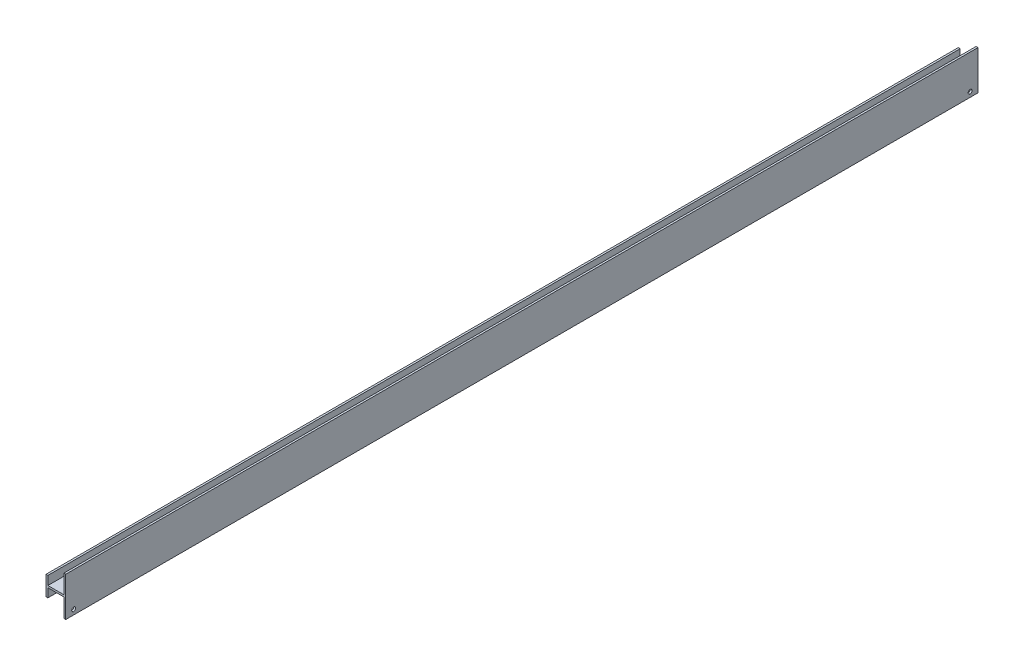
ISO-10303-21;
HEADER;
FILE_DESCRIPTION(('STEP AP214'),'2;1');
FILE_NAME('part.step','',(''),(''),'','','');
FILE_SCHEMA(('AUTOMOTIVE_DESIGN { 1 0 10303 214 1 1 1 1 }'));
ENDSEC;
DATA;
#1=APPLICATION_CONTEXT('core data for automotive mechanical design processes');
#2=APPLICATION_PROTOCOL_DEFINITION('international standard','automotive_design',2000,#1);
#3=PRODUCT_CONTEXT('',#1,'mechanical');
#4=PRODUCT('Part','Part','',(#3));
#5=PRODUCT_RELATED_PRODUCT_CATEGORY('part','',(#4));
#6=PRODUCT_DEFINITION_FORMATION('','',#4);
#7=PRODUCT_DEFINITION_CONTEXT('part definition',#1,'design');
#8=PRODUCT_DEFINITION('design','',#6,#7);
#9=PRODUCT_DEFINITION_SHAPE('','',#8);
#10=(LENGTH_UNIT() NAMED_UNIT(*) SI_UNIT(.MILLI.,.METRE.));
#11=(NAMED_UNIT(*) PLANE_ANGLE_UNIT() SI_UNIT($,.RADIAN.));
#12=(NAMED_UNIT(*) SI_UNIT($,.STERADIAN.) SOLID_ANGLE_UNIT());
#13=UNCERTAINTY_MEASURE_WITH_UNIT(LENGTH_MEASURE(1.E-05),#10,'distance_accuracy_value','');
#14=(GEOMETRIC_REPRESENTATION_CONTEXT(3) GLOBAL_UNCERTAINTY_ASSIGNED_CONTEXT((#13)) GLOBAL_UNIT_ASSIGNED_CONTEXT((#10,
#11,#12)) REPRESENTATION_CONTEXT('',''));
#15=CARTESIAN_POINT('',(0.,0.,0.));
#16=DIRECTION('',(0.,0.,1.));
#17=DIRECTION('',(1.,0.,0.));
#18=AXIS2_PLACEMENT_3D('',#15,#16,#17);
#19=CARTESIAN_POINT('',(58.674,15.6718,364.33125));
#20=DIRECTION('',(0.,-1.,0.));
#21=DIRECTION('',(0.,0.,-1.));
#22=AXIS2_PLACEMENT_3D('',#19,#20,#21);
#23=PLANE('',#22);
#24=DIRECTION('',(-1.,0.,0.));
#25=VECTOR('',#24,1.);
#26=CARTESIAN_POINT('',(58.674,15.6718,-364.33125));
#27=LINE('',#26,#25);
#28=CARTESIAN_POINT('',(58.674,15.6718,-364.33125));
#29=VERTEX_POINT('',#28);
#30=CARTESIAN_POINT('',(57.15,15.6718,-364.33125));
#31=VERTEX_POINT('',#30);
#32=EDGE_CURVE('E151',#29,#31,#27,.T.);
#33=ORIENTED_EDGE('',*,*,#32,.T.);
#34=DIRECTION('',(0.,0.,-1.));
#35=VECTOR('',#34,1.);
#36=CARTESIAN_POINT('',(57.15,15.6718,364.33125));
#37=LINE('',#36,#35);
#38=CARTESIAN_POINT('',(57.15,15.6718,364.33125));
#39=VERTEX_POINT('',#38);
#40=EDGE_CURVE('E11',#39,#31,#37,.T.);
#41=ORIENTED_EDGE('',*,*,#40,.F.);
#42=DIRECTION('',(-1.,0.,0.));
#43=VECTOR('',#42,1.);
#44=CARTESIAN_POINT('',(58.674,15.6718,364.33125));
#45=LINE('',#44,#43);
#46=CARTESIAN_POINT('',(58.674,15.6718,364.33125));
#47=VERTEX_POINT('',#46);
#48=EDGE_CURVE('E174',#47,#39,#45,.T.);
#49=ORIENTED_EDGE('',*,*,#48,.F.);
#50=DIRECTION('',(0.,0.,-1.));
#51=VECTOR('',#50,1.);
#52=CARTESIAN_POINT('',(58.674,15.6718,364.33125));
#53=LINE('',#52,#51);
#54=EDGE_CURVE('E147',#47,#29,#53,.T.);
#55=ORIENTED_EDGE('',*,*,#54,.T.);
#56=EDGE_LOOP('',(#33,#41,#49,#55));
#57=FACE_BOUND('',#56,.T.);
#58=ADVANCED_FACE('F31',(#57),#23,.F.);
#59=CARTESIAN_POINT('',(57.15,15.6718,364.33125));
#60=DIRECTION('',(1.,0.,0.));
#61=DIRECTION('',(0.,0.,-1.));
#62=AXIS2_PLACEMENT_3D('',#59,#60,#61);
#63=PLANE('',#62);
#64=DIRECTION('',(0.,-1.,0.));
#65=VECTOR('',#64,1.);
#66=CARTESIAN_POINT('',(57.15,15.6718,-364.33125));
#67=LINE('',#66,#65);
#68=CARTESIAN_POINT('',(57.15,0.762,-364.33125));
#69=VERTEX_POINT('',#68);
#70=EDGE_CURVE('E154',#31,#69,#67,.T.);
#71=ORIENTED_EDGE('',*,*,#70,.T.);
#72=DIRECTION('',(0.,0.,-1.));
#73=VECTOR('',#72,1.);
#74=CARTESIAN_POINT('',(57.15,0.762,364.33125));
#75=LINE('',#74,#73);
#76=CARTESIAN_POINT('',(57.15,0.762,364.33125));
#77=VERTEX_POINT('',#76);
#78=EDGE_CURVE('E39',#77,#69,#75,.T.);
#79=ORIENTED_EDGE('',*,*,#78,.F.);
#80=DIRECTION('',(0.,-1.,0.));
#81=VECTOR('',#80,1.);
#82=CARTESIAN_POINT('',(57.15,15.6718,364.33125));
#83=LINE('',#82,#81);
#84=EDGE_CURVE('E102',#39,#77,#83,.T.);
#85=ORIENTED_EDGE('',*,*,#84,.F.);
#86=ORIENTED_EDGE('',*,*,#40,.T.);
#87=EDGE_LOOP('',(#71,#79,#85,#86));
#88=FACE_BOUND('',#87,.T.);
#89=ADVANCED_FACE('F255',(#88),#63,.F.);
#90=CARTESIAN_POINT('',(44.45,0.762,364.33125));
#91=DIRECTION('',(0.,-1.,0.));
#92=DIRECTION('',(0.,0.,-1.));
#93=AXIS2_PLACEMENT_3D('',#90,#91,#92);
#94=PLANE('',#93);
#95=DIRECTION('',(-1.,0.,0.));
#96=VECTOR('',#95,1.);
#97=CARTESIAN_POINT('',(44.45,0.762,-364.33125));
#98=LINE('',#97,#96);
#99=CARTESIAN_POINT('',(44.45,0.762,-364.33125));
#100=VERTEX_POINT('',#99);
#101=EDGE_CURVE('E157',#69,#100,#98,.T.);
#102=ORIENTED_EDGE('',*,*,#101,.T.);
#103=DIRECTION('',(0.,0.,-1.));
#104=VECTOR('',#103,1.);
#105=CARTESIAN_POINT('',(44.45,0.762,364.33125));
#106=LINE('',#105,#104);
#107=CARTESIAN_POINT('',(44.45,0.762,364.33125));
#108=VERTEX_POINT('',#107);
#109=EDGE_CURVE('E193',#108,#100,#106,.T.);
#110=ORIENTED_EDGE('',*,*,#109,.F.);
#111=DIRECTION('',(-1.,0.,0.));
#112=VECTOR('',#111,1.);
#113=CARTESIAN_POINT('',(44.45,0.762,364.33125));
#114=LINE('',#113,#112);
#115=EDGE_CURVE('E201',#77,#108,#114,.T.);
#116=ORIENTED_EDGE('',*,*,#115,.F.);
#117=ORIENTED_EDGE('',*,*,#78,.T.);
#118=EDGE_LOOP('',(#102,#110,#116,#117));
#119=FACE_BOUND('',#118,.T.);
#120=ADVANCED_FACE('F199',(#119),#94,.F.);
#121=CARTESIAN_POINT('',(44.45,7.7851,364.33125));
#122=DIRECTION('',(-1.,0.,0.));
#123=DIRECTION('',(0.,0.,1.));
#124=AXIS2_PLACEMENT_3D('',#121,#122,#123);
#125=PLANE('',#124);
#126=DIRECTION('',(0.,1.,0.));
#127=VECTOR('',#126,1.);
#128=CARTESIAN_POINT('',(44.45,7.7851,-364.33125));
#129=LINE('',#128,#127);
#130=CARTESIAN_POINT('',(44.45,7.7851,-364.33125));
#131=VERTEX_POINT('',#130);
#132=EDGE_CURVE('E159',#100,#131,#129,.T.);
#133=ORIENTED_EDGE('',*,*,#132,.T.);
#134=DIRECTION('',(0.,0.,-1.));
#135=VECTOR('',#134,1.);
#136=CARTESIAN_POINT('',(44.45,7.7851,364.33125));
#137=LINE('',#136,#135);
#138=CARTESIAN_POINT('',(44.45,7.7851,364.33125));
#139=VERTEX_POINT('',#138);
#140=EDGE_CURVE('E190',#139,#131,#137,.T.);
#141=ORIENTED_EDGE('',*,*,#140,.F.);
#142=DIRECTION('',(0.,1.,0.));
#143=VECTOR('',#142,1.);
#144=CARTESIAN_POINT('',(44.45,7.7851,364.33125));
#145=LINE('',#144,#143);
#146=EDGE_CURVE('E219',#108,#139,#145,.T.);
#147=ORIENTED_EDGE('',*,*,#146,.F.);
#148=ORIENTED_EDGE('',*,*,#109,.T.);
#149=EDGE_LOOP('',(#133,#141,#147,#148));
#150=FACE_BOUND('',#149,.T.);
#151=ADVANCED_FACE('F210',(#150),#125,.F.);
#152=CARTESIAN_POINT('',(42.926,7.7851,364.33125));
#153=DIRECTION('',(0.,-1.,0.));
#154=DIRECTION('',(0.,0.,-1.));
#155=AXIS2_PLACEMENT_3D('',#152,#153,#154);
#156=PLANE('',#155);
#157=DIRECTION('',(-1.,0.,0.));
#158=VECTOR('',#157,1.);
#159=CARTESIAN_POINT('',(42.926,7.7851,-364.33125));
#160=LINE('',#159,#158);
#161=CARTESIAN_POINT('',(42.926,7.7851,-364.33125));
#162=VERTEX_POINT('',#161);
#163=EDGE_CURVE('E161',#131,#162,#160,.T.);
#164=ORIENTED_EDGE('',*,*,#163,.T.);
#165=DIRECTION('',(0.,0.,-1.));
#166=VECTOR('',#165,1.);
#167=CARTESIAN_POINT('',(42.926,7.7851,364.33125));
#168=LINE('',#167,#166);
#169=CARTESIAN_POINT('',(42.926,7.7851,364.33125));
#170=VERTEX_POINT('',#169);
#171=EDGE_CURVE('E187',#170,#162,#168,.T.);
#172=ORIENTED_EDGE('',*,*,#171,.F.);
#173=DIRECTION('',(-1.,0.,0.));
#174=VECTOR('',#173,1.);
#175=CARTESIAN_POINT('',(42.926,7.7851,364.33125));
#176=LINE('',#175,#174);
#177=EDGE_CURVE('E216',#139,#170,#176,.T.);
#178=ORIENTED_EDGE('',*,*,#177,.F.);
#179=ORIENTED_EDGE('',*,*,#140,.T.);
#180=EDGE_LOOP('',(#164,#172,#178,#179));
#181=FACE_BOUND('',#180,.T.);
#182=ADVANCED_FACE('F214',(#181),#156,.F.);
#183=CARTESIAN_POINT('',(42.926,7.7851,364.33125));
#184=DIRECTION('',(1.,0.,0.));
#185=DIRECTION('',(0.,0.,-1.));
#186=AXIS2_PLACEMENT_3D('',#183,#184,#185);
#187=PLANE('',#186);
#188=DIRECTION('',(0.,-1.,0.));
#189=VECTOR('',#188,1.);
#190=CARTESIAN_POINT('',(42.926,7.7851,-364.33125));
#191=LINE('',#190,#189);
#192=CARTESIAN_POINT('',(42.926,-7.7851,-364.33125));
#193=VERTEX_POINT('',#192);
#194=EDGE_CURVE('E163',#162,#193,#191,.T.);
#195=ORIENTED_EDGE('',*,*,#194,.T.);
#196=DIRECTION('',(0.,0.,-1.));
#197=VECTOR('',#196,1.);
#198=CARTESIAN_POINT('',(42.926,-7.7851,364.33125));
#199=LINE('',#198,#197);
#200=CARTESIAN_POINT('',(42.926,-7.7851,364.33125));
#201=VERTEX_POINT('',#200);
#202=EDGE_CURVE('E184',#201,#193,#199,.T.);
#203=ORIENTED_EDGE('',*,*,#202,.F.);
#204=DIRECTION('',(0.,-1.,0.));
#205=VECTOR('',#204,1.);
#206=CARTESIAN_POINT('',(42.926,7.7851,364.33125));
#207=LINE('',#206,#205);
#208=EDGE_CURVE('E218',#170,#201,#207,.T.);
#209=ORIENTED_EDGE('',*,*,#208,.F.);
#210=ORIENTED_EDGE('',*,*,#171,.T.);
#211=EDGE_LOOP('',(#195,#203,#209,#210));
#212=FACE_BOUND('',#211,.T.);
#213=ADVANCED_FACE('F268',(#212),#187,.F.);
#214=CARTESIAN_POINT('',(42.926,-7.7851,364.33125));
#215=DIRECTION('',(0.,1.,0.));
#216=DIRECTION('',(0.,0.,1.));
#217=AXIS2_PLACEMENT_3D('',#214,#215,#216);
#218=PLANE('',#217);
#219=DIRECTION('',(1.,0.,0.));
#220=VECTOR('',#219,1.);
#221=CARTESIAN_POINT('',(42.926,-7.7851,-364.33125));
#222=LINE('',#221,#220);
#223=CARTESIAN_POINT('',(44.45,-7.7851,-364.33125));
#224=VERTEX_POINT('',#223);
#225=EDGE_CURVE('E165',#193,#224,#222,.T.);
#226=ORIENTED_EDGE('',*,*,#225,.T.);
#227=DIRECTION('',(0.,0.,-1.));
#228=VECTOR('',#227,1.);
#229=CARTESIAN_POINT('',(44.45,-7.7851,364.33125));
#230=LINE('',#229,#228);
#231=CARTESIAN_POINT('',(44.45,-7.7851,364.33125));
#232=VERTEX_POINT('',#231);
#233=EDGE_CURVE('E181',#232,#224,#230,.T.);
#234=ORIENTED_EDGE('',*,*,#233,.F.);
#235=DIRECTION('',(1.,0.,0.));
#236=VECTOR('',#235,1.);
#237=CARTESIAN_POINT('',(42.926,-7.7851,364.33125));
#238=LINE('',#237,#236);
#239=EDGE_CURVE('E221',#201,#232,#238,.T.);
#240=ORIENTED_EDGE('',*,*,#239,.F.);
#241=ORIENTED_EDGE('',*,*,#202,.T.);
#242=EDGE_LOOP('',(#226,#234,#240,#241));
#243=FACE_BOUND('',#242,.T.);
#244=ADVANCED_FACE('F271',(#243),#218,.F.);
#245=CARTESIAN_POINT('',(44.45,-7.7851,364.33125));
#246=DIRECTION('',(-1.,0.,0.));
#247=DIRECTION('',(0.,0.,1.));
#248=AXIS2_PLACEMENT_3D('',#245,#246,#247);
#249=PLANE('',#248);
#250=DIRECTION('',(0.,1.,0.));
#251=VECTOR('',#250,1.);
#252=CARTESIAN_POINT('',(44.45,-7.7851,-364.33125));
#253=LINE('',#252,#251);
#254=CARTESIAN_POINT('',(44.45,-0.762,-364.33125));
#255=VERTEX_POINT('',#254);
#256=EDGE_CURVE('E167',#224,#255,#253,.T.);
#257=ORIENTED_EDGE('',*,*,#256,.T.);
#258=DIRECTION('',(0.,0.,-1.));
#259=VECTOR('',#258,1.);
#260=CARTESIAN_POINT('',(44.45,-0.762,364.33125));
#261=LINE('',#260,#259);
#262=CARTESIAN_POINT('',(44.45,-0.762,364.33125));
#263=VERTEX_POINT('',#262);
#264=EDGE_CURVE('E178',#263,#255,#261,.T.);
#265=ORIENTED_EDGE('',*,*,#264,.F.);
#266=DIRECTION('',(0.,1.,0.));
#267=VECTOR('',#266,1.);
#268=CARTESIAN_POINT('',(44.45,-7.7851,364.33125));
#269=LINE('',#268,#267);
#270=EDGE_CURVE('E227',#232,#263,#269,.T.);
#271=ORIENTED_EDGE('',*,*,#270,.F.);
#272=ORIENTED_EDGE('',*,*,#233,.T.);
#273=EDGE_LOOP('',(#257,#265,#271,#272));
#274=FACE_BOUND('',#273,.T.);
#275=ADVANCED_FACE('F233',(#274),#249,.F.);
#276=CARTESIAN_POINT('',(44.45,-0.762,364.33125));
#277=DIRECTION('',(0.,1.,0.));
#278=DIRECTION('',(0.,0.,1.));
#279=AXIS2_PLACEMENT_3D('',#276,#277,#278);
#280=PLANE('',#279);
#281=DIRECTION('',(1.,0.,0.));
#282=VECTOR('',#281,1.);
#283=CARTESIAN_POINT('',(44.45,-0.762,-364.33125));
#284=LINE('',#283,#282);
#285=CARTESIAN_POINT('',(57.15,-0.762,-364.33125));
#286=VERTEX_POINT('',#285);
#287=EDGE_CURVE('E169',#255,#286,#284,.T.);
#288=ORIENTED_EDGE('',*,*,#287,.T.);
#289=DIRECTION('',(0.,0.,-1.));
#290=VECTOR('',#289,1.);
#291=CARTESIAN_POINT('',(57.15,-0.762,364.33125));
#292=LINE('',#291,#290);
#293=CARTESIAN_POINT('',(57.15,-0.762,364.33125));
#294=VERTEX_POINT('',#293);
#295=EDGE_CURVE('E142',#294,#286,#292,.T.);
#296=ORIENTED_EDGE('',*,*,#295,.F.);
#297=DIRECTION('',(1.,0.,0.));
#298=VECTOR('',#297,1.);
#299=CARTESIAN_POINT('',(44.45,-0.762,364.33125));
#300=LINE('',#299,#298);
#301=EDGE_CURVE('E133',#263,#294,#300,.T.);
#302=ORIENTED_EDGE('',*,*,#301,.F.);
#303=ORIENTED_EDGE('',*,*,#264,.T.);
#304=EDGE_LOOP('',(#288,#296,#302,#303));
#305=FACE_BOUND('',#304,.T.);
#306=ADVANCED_FACE('F237',(#305),#280,.F.);
#307=CARTESIAN_POINT('',(57.15,-15.6718,364.33125));
#308=DIRECTION('',(1.,0.,0.));
#309=DIRECTION('',(0.,0.,-1.));
#310=AXIS2_PLACEMENT_3D('',#307,#308,#309);
#311=PLANE('',#310);
#312=CARTESIAN_POINT('',(57.15,-11.7284500000001,-357.98125));
#313=DIRECTION('',(-1.,0.,0.));
#314=DIRECTION('',(0.,0.,1.));
#315=AXIS2_PLACEMENT_3D('',#312,#313,#314);
#316=CIRCLE('',#315,1.58750000000004);
#317=CARTESIAN_POINT('',(57.15,-11.7284500000001,-356.39375));
#318=VERTEX_POINT('',#317);
#319=EDGE_CURVE('E287',#318,#318,#316,.T.);
#320=ORIENTED_EDGE('',*,*,#319,.F.);
#321=EDGE_LOOP('',(#320));
#322=FACE_BOUND('',#321,.T.);
#323=CARTESIAN_POINT('',(57.15,-11.72845,357.98125));
#324=DIRECTION('',(-1.,0.,0.));
#325=DIRECTION('',(0.,0.,1.));
#326=AXIS2_PLACEMENT_3D('',#323,#324,#325);
#327=CIRCLE('',#326,1.58750000000004);
#328=CARTESIAN_POINT('',(57.15,-11.72845,359.56875));
#329=VERTEX_POINT('',#328);
#330=EDGE_CURVE('E290',#329,#329,#327,.T.);
#331=ORIENTED_EDGE('',*,*,#330,.F.);
#332=EDGE_LOOP('',(#331));
#333=FACE_BOUND('',#332,.T.);
#334=DIRECTION('',(0.,-1.,0.));
#335=VECTOR('',#334,1.);
#336=CARTESIAN_POINT('',(57.15,-15.6718,-364.33125));
#337=LINE('',#336,#335);
#338=CARTESIAN_POINT('',(57.15,-15.6718,-364.33125));
#339=VERTEX_POINT('',#338);
#340=EDGE_CURVE('E141',#286,#339,#337,.T.);
#341=ORIENTED_EDGE('',*,*,#340,.T.);
#342=DIRECTION('',(0.,0.,-1.));
#343=VECTOR('',#342,1.);
#344=CARTESIAN_POINT('',(57.15,-15.6718,364.33125));
#345=LINE('',#344,#343);
#346=CARTESIAN_POINT('',(57.15,-15.6718,364.33125));
#347=VERTEX_POINT('',#346);
#348=EDGE_CURVE('E138',#347,#339,#345,.T.);
#349=ORIENTED_EDGE('',*,*,#348,.F.);
#350=DIRECTION('',(0.,-1.,0.));
#351=VECTOR('',#350,1.);
#352=CARTESIAN_POINT('',(57.15,-15.6718,364.33125));
#353=LINE('',#352,#351);
#354=EDGE_CURVE('E127',#294,#347,#353,.T.);
#355=ORIENTED_EDGE('',*,*,#354,.F.);
#356=ORIENTED_EDGE('',*,*,#295,.T.);
#357=EDGE_LOOP('',(#341,#349,#355,#356));
#358=FACE_BOUND('',#357,.T.);
#359=ADVANCED_FACE('F139',(#322,#333,#358),#311,.F.);
#360=CARTESIAN_POINT('',(58.674,-15.6718,364.33125));
#361=DIRECTION('',(0.,1.,0.));
#362=DIRECTION('',(0.,0.,1.));
#363=AXIS2_PLACEMENT_3D('',#360,#361,#362);
#364=PLANE('',#363);
#365=DIRECTION('',(1.,0.,0.));
#366=VECTOR('',#365,1.);
#367=CARTESIAN_POINT('',(58.674,-15.6718,-364.33125));
#368=LINE('',#367,#366);
#369=CARTESIAN_POINT('',(58.674,-15.6718,-364.33125));
#370=VERTEX_POINT('',#369);
#371=EDGE_CURVE('E88',#339,#370,#368,.T.);
#372=ORIENTED_EDGE('',*,*,#371,.T.);
#373=DIRECTION('',(0.,0.,-1.));
#374=VECTOR('',#373,1.);
#375=CARTESIAN_POINT('',(58.674,-15.6718,364.33125));
#376=LINE('',#375,#374);
#377=CARTESIAN_POINT('',(58.674,-15.6718,364.33125));
#378=VERTEX_POINT('',#377);
#379=EDGE_CURVE('E143',#378,#370,#376,.T.);
#380=ORIENTED_EDGE('',*,*,#379,.F.);
#381=DIRECTION('',(1.,0.,0.));
#382=VECTOR('',#381,1.);
#383=CARTESIAN_POINT('',(58.674,-15.6718,364.33125));
#384=LINE('',#383,#382);
#385=EDGE_CURVE('E131',#347,#378,#384,.T.);
#386=ORIENTED_EDGE('',*,*,#385,.F.);
#387=ORIENTED_EDGE('',*,*,#348,.T.);
#388=EDGE_LOOP('',(#372,#380,#386,#387));
#389=FACE_BOUND('',#388,.T.);
#390=ADVANCED_FACE('F145',(#389),#364,.F.);
#391=CARTESIAN_POINT('',(58.674,15.6718,364.33125));
#392=DIRECTION('',(-1.,0.,0.));
#393=DIRECTION('',(0.,0.,1.));
#394=AXIS2_PLACEMENT_3D('',#391,#392,#393);
#395=PLANE('',#394);
#396=CARTESIAN_POINT('',(58.674,-11.7284500000001,-357.98125));
#397=DIRECTION('',(-1.,0.,0.));
#398=DIRECTION('',(0.,0.,1.));
#399=AXIS2_PLACEMENT_3D('',#396,#397,#398);
#400=CIRCLE('',#399,1.58750000000004);
#401=CARTESIAN_POINT('',(58.674,-11.7284500000001,-356.39375));
#402=VERTEX_POINT('',#401);
#403=EDGE_CURVE('E292',#402,#402,#400,.F.);
#404=ORIENTED_EDGE('',*,*,#403,.F.);
#405=EDGE_LOOP('',(#404));
#406=FACE_BOUND('',#405,.T.);
#407=CARTESIAN_POINT('',(58.674,-11.72845,357.98125));
#408=DIRECTION('',(-1.,0.,0.));
#409=DIRECTION('',(0.,0.,1.));
#410=AXIS2_PLACEMENT_3D('',#407,#408,#409);
#411=CIRCLE('',#410,1.58750000000004);
#412=CARTESIAN_POINT('',(58.674,-11.72845,359.56875));
#413=VERTEX_POINT('',#412);
#414=EDGE_CURVE('E155',#413,#413,#411,.F.);
#415=ORIENTED_EDGE('',*,*,#414,.F.);
#416=EDGE_LOOP('',(#415));
#417=FACE_BOUND('',#416,.T.);
#418=DIRECTION('',(0.,1.,0.));
#419=VECTOR('',#418,1.);
#420=CARTESIAN_POINT('',(58.674,15.6718,-364.33125));
#421=LINE('',#420,#419);
#422=EDGE_CURVE('E94',#370,#29,#421,.T.);
#423=ORIENTED_EDGE('',*,*,#422,.T.);
#424=ORIENTED_EDGE('',*,*,#54,.F.);
#425=DIRECTION('',(0.,1.,0.));
#426=VECTOR('',#425,1.);
#427=CARTESIAN_POINT('',(58.674,15.6718,364.33125));
#428=LINE('',#427,#426);
#429=EDGE_CURVE('E47',#378,#47,#428,.T.);
#430=ORIENTED_EDGE('',*,*,#429,.F.);
#431=ORIENTED_EDGE('',*,*,#379,.T.);
#432=EDGE_LOOP('',(#423,#424,#430,#431));
#433=FACE_BOUND('',#432,.T.);
#434=ADVANCED_FACE('F241',(#406,#417,#433),#395,.F.);
#435=CARTESIAN_POINT('',(57.15,15.6718,364.33125));
#436=DIRECTION('',(0.,0.,1.));
#437=DIRECTION('',(1.,0.,0.));
#438=AXIS2_PLACEMENT_3D('',#435,#436,#437);
#439=PLANE('',#438);
#440=ORIENTED_EDGE('',*,*,#48,.T.);
#441=ORIENTED_EDGE('',*,*,#84,.T.);
#442=ORIENTED_EDGE('',*,*,#115,.T.);
#443=ORIENTED_EDGE('',*,*,#146,.T.);
#444=ORIENTED_EDGE('',*,*,#177,.T.);
#445=ORIENTED_EDGE('',*,*,#208,.T.);
#446=ORIENTED_EDGE('',*,*,#239,.T.);
#447=ORIENTED_EDGE('',*,*,#270,.T.);
#448=ORIENTED_EDGE('',*,*,#301,.T.);
#449=ORIENTED_EDGE('',*,*,#354,.T.);
#450=ORIENTED_EDGE('',*,*,#385,.T.);
#451=ORIENTED_EDGE('',*,*,#429,.T.);
#452=EDGE_LOOP('',(#440,#441,#442,#443,#444,#445,#446,#447,#448,#449,#450,#451));
#453=FACE_BOUND('',#452,.T.);
#454=ADVANCED_FACE('F129',(#453),#439,.T.);
#455=CARTESIAN_POINT('',(57.15,15.6718,-364.33125));
#456=DIRECTION('',(0.,0.,1.));
#457=DIRECTION('',(1.,0.,0.));
#458=AXIS2_PLACEMENT_3D('',#455,#456,#457);
#459=PLANE('',#458);
#460=ORIENTED_EDGE('',*,*,#32,.F.);
#461=ORIENTED_EDGE('',*,*,#422,.F.);
#462=ORIENTED_EDGE('',*,*,#371,.F.);
#463=ORIENTED_EDGE('',*,*,#340,.F.);
#464=ORIENTED_EDGE('',*,*,#287,.F.);
#465=ORIENTED_EDGE('',*,*,#256,.F.);
#466=ORIENTED_EDGE('',*,*,#225,.F.);
#467=ORIENTED_EDGE('',*,*,#194,.F.);
#468=ORIENTED_EDGE('',*,*,#163,.F.);
#469=ORIENTED_EDGE('',*,*,#132,.F.);
#470=ORIENTED_EDGE('',*,*,#101,.F.);
#471=ORIENTED_EDGE('',*,*,#70,.F.);
#472=EDGE_LOOP('',(#460,#461,#462,#463,#464,#465,#466,#467,#468,#469,#470,#471));
#473=FACE_BOUND('',#472,.T.);
#474=ADVANCED_FACE('F205',(#473),#459,.F.);
#475=CARTESIAN_POINT('',(63.1641280605347,-11.72845,357.98125));
#476=DIRECTION('',(-1.,0.,0.));
#477=DIRECTION('',(0.,0.,1.));
#478=AXIS2_PLACEMENT_3D('',#475,#476,#477);
#479=CYLINDRICAL_SURFACE('',#478,1.58750000000004);
#480=ORIENTED_EDGE('',*,*,#414,.T.);
#481=EDGE_LOOP('',(#480));
#482=FACE_BOUND('',#481,.T.);
#483=ORIENTED_EDGE('',*,*,#330,.T.);
#484=EDGE_LOOP('',(#483));
#485=FACE_BOUND('',#484,.T.);
#486=ADVANCED_FACE('F304',(#482,#485),#479,.F.);
#487=CARTESIAN_POINT('',(63.1641280605347,-11.7284500000001,-357.98125));
#488=DIRECTION('',(-1.,0.,0.));
#489=DIRECTION('',(0.,0.,1.));
#490=AXIS2_PLACEMENT_3D('',#487,#488,#489);
#491=CYLINDRICAL_SURFACE('',#490,1.58750000000004);
#492=ORIENTED_EDGE('',*,*,#403,.T.);
#493=EDGE_LOOP('',(#492));
#494=FACE_BOUND('',#493,.T.);
#495=ORIENTED_EDGE('',*,*,#319,.T.);
#496=EDGE_LOOP('',(#495));
#497=FACE_BOUND('',#496,.T.);
#498=ADVANCED_FACE('F302',(#494,#497),#491,.F.);
#499=CLOSED_SHELL('',(#58,#89,#120,#151,#182,#213,#244,#275,#306,#359,#390,#434,#454,#474,#486,#498));
#500=MANIFOLD_SOLID_BREP('B2',#499);
#501=ADVANCED_BREP_SHAPE_REPRESENTATION('',(#18,#500),#14);
#502=SHAPE_DEFINITION_REPRESENTATION(#9,#501);
ENDSEC;
END-ISO-10303-21;
